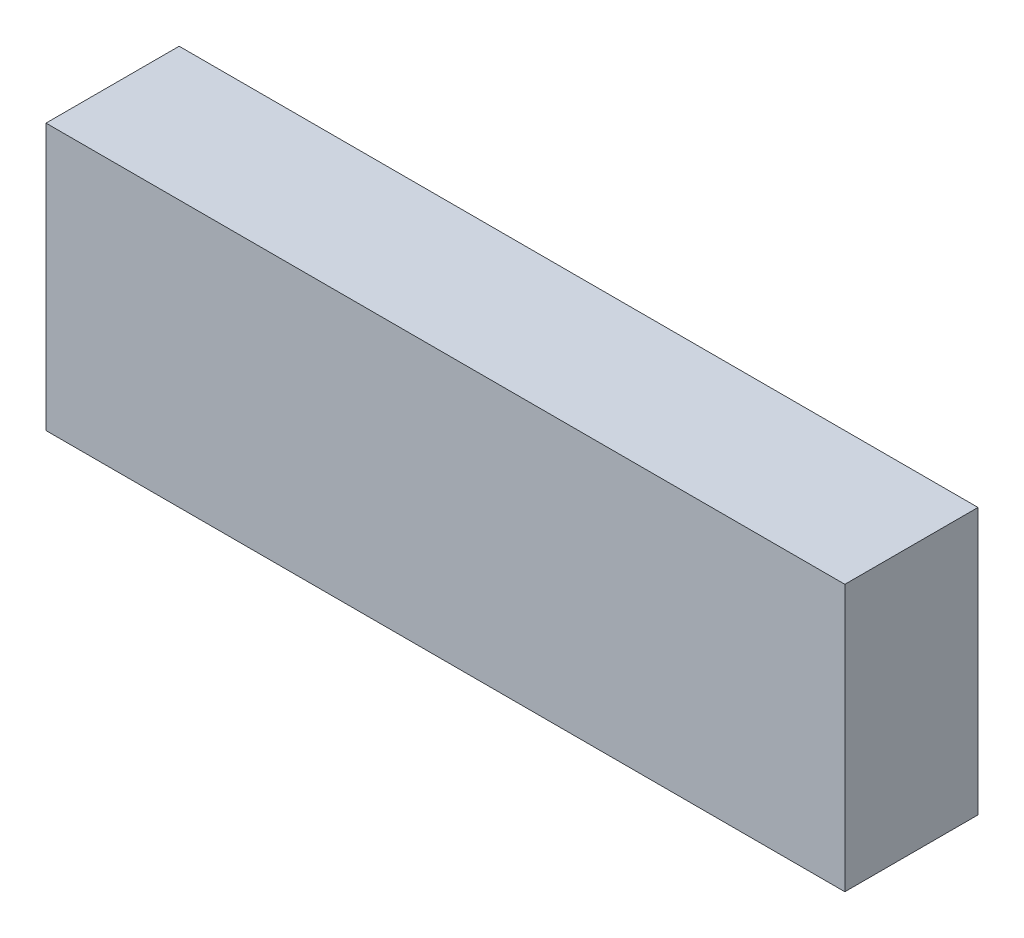
ISO-10303-21;
HEADER;
FILE_DESCRIPTION(('STEP AP214'),'2;1');
FILE_NAME('part.step','',(''),(''),'','','');
FILE_SCHEMA(('AUTOMOTIVE_DESIGN { 1 0 10303 214 1 1 1 1 }'));
ENDSEC;
DATA;
#1=APPLICATION_CONTEXT('core data for automotive mechanical design processes');
#2=APPLICATION_PROTOCOL_DEFINITION('international standard','automotive_design',2000,#1);
#3=PRODUCT_CONTEXT('',#1,'mechanical');
#4=PRODUCT('Part','Part','',(#3));
#5=PRODUCT_RELATED_PRODUCT_CATEGORY('part','',(#4));
#6=PRODUCT_DEFINITION_FORMATION('','',#4);
#7=PRODUCT_DEFINITION_CONTEXT('part definition',#1,'design');
#8=PRODUCT_DEFINITION('design','',#6,#7);
#9=PRODUCT_DEFINITION_SHAPE('','',#8);
#10=(LENGTH_UNIT() NAMED_UNIT(*) SI_UNIT(.MILLI.,.METRE.));
#11=(NAMED_UNIT(*) PLANE_ANGLE_UNIT() SI_UNIT($,.RADIAN.));
#12=(NAMED_UNIT(*) SI_UNIT($,.STERADIAN.) SOLID_ANGLE_UNIT());
#13=UNCERTAINTY_MEASURE_WITH_UNIT(LENGTH_MEASURE(1.E-05),#10,'distance_accuracy_value','');
#14=(GEOMETRIC_REPRESENTATION_CONTEXT(3) GLOBAL_UNCERTAINTY_ASSIGNED_CONTEXT((#13)) GLOBAL_UNIT_ASSIGNED_CONTEXT((#10,
#11,#12)) REPRESENTATION_CONTEXT('',''));
#15=CARTESIAN_POINT('',(0.,0.,0.));
#16=DIRECTION('',(0.,0.,1.));
#17=DIRECTION('',(1.,0.,0.));
#18=AXIS2_PLACEMENT_3D('',#15,#16,#17);
#19=CARTESIAN_POINT('',(1.375,-1.225,0.));
#20=DIRECTION('',(1.,0.,0.));
#21=DIRECTION('',(0.,0.,1.));
#22=AXIS2_PLACEMENT_3D('',#19,#20,#21);
#23=PLANE('',#22);
#24=DIRECTION('',(0.,1.,0.));
#25=VECTOR('',#24,1.);
#26=CARTESIAN_POINT('',(1.375,-1.225,0.1));
#27=LINE('',#26,#25);
#28=CARTESIAN_POINT('',(1.375,-1.225,0.1));
#29=VERTEX_POINT('',#28);
#30=CARTESIAN_POINT('',(1.375,-1.025,0.1));
#31=VERTEX_POINT('',#30);
#32=EDGE_CURVE('E11',#29,#31,#27,.T.);
#33=ORIENTED_EDGE('',*,*,#32,.T.);
#34=DIRECTION('',(0.,0.,1.));
#35=VECTOR('',#34,1.);
#36=CARTESIAN_POINT('',(1.375,-1.025,0.));
#37=LINE('',#36,#35);
#38=CARTESIAN_POINT('',(1.375,-1.025,0.));
#39=VERTEX_POINT('',#38);
#40=EDGE_CURVE('E24',#39,#31,#37,.T.);
#41=ORIENTED_EDGE('',*,*,#40,.F.);
#42=DIRECTION('',(0.,1.,0.));
#43=VECTOR('',#42,1.);
#44=CARTESIAN_POINT('',(1.375,-1.225,0.));
#45=LINE('',#44,#43);
#46=CARTESIAN_POINT('',(1.375,-1.225,0.));
#47=VERTEX_POINT('',#46);
#48=EDGE_CURVE('E86',#47,#39,#45,.T.);
#49=ORIENTED_EDGE('',*,*,#48,.F.);
#50=DIRECTION('',(0.,0.,1.));
#51=VECTOR('',#50,1.);
#52=CARTESIAN_POINT('',(1.375,-1.225,0.));
#53=LINE('',#52,#51);
#54=EDGE_CURVE('E36',#47,#29,#53,.T.);
#55=ORIENTED_EDGE('',*,*,#54,.T.);
#56=EDGE_LOOP('',(#33,#41,#49,#55));
#57=FACE_BOUND('',#56,.T.);
#58=ADVANCED_FACE('F17',(#57),#23,.F.);
#59=CARTESIAN_POINT('',(1.975,-1.225,0.));
#60=DIRECTION('',(1.,0.,0.));
#61=DIRECTION('',(0.,0.,1.));
#62=AXIS2_PLACEMENT_3D('',#59,#60,#61);
#63=PLANE('',#62);
#64=DIRECTION('',(0.,0.,1.));
#65=VECTOR('',#64,1.);
#66=CARTESIAN_POINT('',(1.975,-1.225,0.));
#67=LINE('',#66,#65);
#68=CARTESIAN_POINT('',(1.975,-1.225,0.));
#69=VERTEX_POINT('',#68);
#70=CARTESIAN_POINT('',(1.975,-1.225,0.1));
#71=VERTEX_POINT('',#70);
#72=EDGE_CURVE('E83',#69,#71,#67,.T.);
#73=ORIENTED_EDGE('',*,*,#72,.F.);
#74=DIRECTION('',(0.,1.,0.));
#75=VECTOR('',#74,1.);
#76=CARTESIAN_POINT('',(1.975,-1.225,0.));
#77=LINE('',#76,#75);
#78=CARTESIAN_POINT('',(1.975,-1.025,0.));
#79=VERTEX_POINT('',#78);
#80=EDGE_CURVE('E63',#69,#79,#77,.T.);
#81=ORIENTED_EDGE('',*,*,#80,.T.);
#82=DIRECTION('',(0.,0.,1.));
#83=VECTOR('',#82,1.);
#84=CARTESIAN_POINT('',(1.975,-1.025,0.));
#85=LINE('',#84,#83);
#86=CARTESIAN_POINT('',(1.975,-1.025,0.1));
#87=VERTEX_POINT('',#86);
#88=EDGE_CURVE('E57',#79,#87,#85,.T.);
#89=ORIENTED_EDGE('',*,*,#88,.T.);
#90=DIRECTION('',(0.,1.,0.));
#91=VECTOR('',#90,1.);
#92=CARTESIAN_POINT('',(1.975,-1.225,0.1));
#93=LINE('',#92,#91);
#94=EDGE_CURVE('E60',#71,#87,#93,.T.);
#95=ORIENTED_EDGE('',*,*,#94,.F.);
#96=EDGE_LOOP('',(#73,#81,#89,#95));
#97=FACE_BOUND('',#96,.T.);
#98=ADVANCED_FACE('F59',(#97),#63,.T.);
#99=CARTESIAN_POINT('',(1.375,-1.225,0.));
#100=DIRECTION('',(0.,1.,0.));
#101=DIRECTION('',(0.,0.,1.));
#102=AXIS2_PLACEMENT_3D('',#99,#100,#101);
#103=PLANE('',#102);
#104=ORIENTED_EDGE('',*,*,#72,.T.);
#105=DIRECTION('',(1.,0.,0.));
#106=VECTOR('',#105,1.);
#107=CARTESIAN_POINT('',(1.375,-1.225,0.1));
#108=LINE('',#107,#106);
#109=EDGE_CURVE('E71',#29,#71,#108,.T.);
#110=ORIENTED_EDGE('',*,*,#109,.F.);
#111=ORIENTED_EDGE('',*,*,#54,.F.);
#112=DIRECTION('',(1.,0.,0.));
#113=VECTOR('',#112,1.);
#114=CARTESIAN_POINT('',(1.375,-1.225,0.));
#115=LINE('',#114,#113);
#116=EDGE_CURVE('E76',#47,#69,#115,.T.);
#117=ORIENTED_EDGE('',*,*,#116,.T.);
#118=EDGE_LOOP('',(#104,#110,#111,#117));
#119=FACE_BOUND('',#118,.T.);
#120=ADVANCED_FACE('F91',(#119),#103,.F.);
#121=CARTESIAN_POINT('',(1.375,-1.025,0.));
#122=DIRECTION('',(0.,1.,0.));
#123=DIRECTION('',(0.,0.,1.));
#124=AXIS2_PLACEMENT_3D('',#121,#122,#123);
#125=PLANE('',#124);
#126=DIRECTION('',(1.,0.,0.));
#127=VECTOR('',#126,1.);
#128=CARTESIAN_POINT('',(1.375,-1.025,0.));
#129=LINE('',#128,#127);
#130=EDGE_CURVE('E74',#39,#79,#129,.T.);
#131=ORIENTED_EDGE('',*,*,#130,.F.);
#132=ORIENTED_EDGE('',*,*,#40,.T.);
#133=DIRECTION('',(1.,0.,0.));
#134=VECTOR('',#133,1.);
#135=CARTESIAN_POINT('',(1.375,-1.025,0.1));
#136=LINE('',#135,#134);
#137=EDGE_CURVE('E69',#31,#87,#136,.T.);
#138=ORIENTED_EDGE('',*,*,#137,.T.);
#139=ORIENTED_EDGE('',*,*,#88,.F.);
#140=EDGE_LOOP('',(#131,#132,#138,#139));
#141=FACE_BOUND('',#140,.T.);
#142=ADVANCED_FACE('F73',(#141),#125,.T.);
#143=CARTESIAN_POINT('',(1.375,-1.225,0.));
#144=DIRECTION('',(0.,0.,1.));
#145=DIRECTION('',(1.,0.,0.));
#146=AXIS2_PLACEMENT_3D('',#143,#144,#145);
#147=PLANE('',#146);
#148=ORIENTED_EDGE('',*,*,#130,.T.);
#149=ORIENTED_EDGE('',*,*,#80,.F.);
#150=ORIENTED_EDGE('',*,*,#116,.F.);
#151=ORIENTED_EDGE('',*,*,#48,.T.);
#152=EDGE_LOOP('',(#148,#149,#150,#151));
#153=FACE_BOUND('',#152,.T.);
#154=ADVANCED_FACE('F89',(#153),#147,.F.);
#155=CARTESIAN_POINT('',(1.375,-1.225,0.1));
#156=DIRECTION('',(0.,0.,1.));
#157=DIRECTION('',(1.,0.,0.));
#158=AXIS2_PLACEMENT_3D('',#155,#156,#157);
#159=PLANE('',#158);
#160=ORIENTED_EDGE('',*,*,#32,.F.);
#161=ORIENTED_EDGE('',*,*,#109,.T.);
#162=ORIENTED_EDGE('',*,*,#94,.T.);
#163=ORIENTED_EDGE('',*,*,#137,.F.);
#164=EDGE_LOOP('',(#160,#161,#162,#163));
#165=FACE_BOUND('',#164,.T.);
#166=ADVANCED_FACE('F68',(#165),#159,.T.);
#167=CLOSED_SHELL('',(#58,#98,#120,#142,#154,#166));
#168=MANIFOLD_SOLID_BREP('B1',#167);
#169=ADVANCED_BREP_SHAPE_REPRESENTATION('',(#18,#168),#14);
#170=SHAPE_DEFINITION_REPRESENTATION(#9,#169);
ENDSEC;
END-ISO-10303-21;
